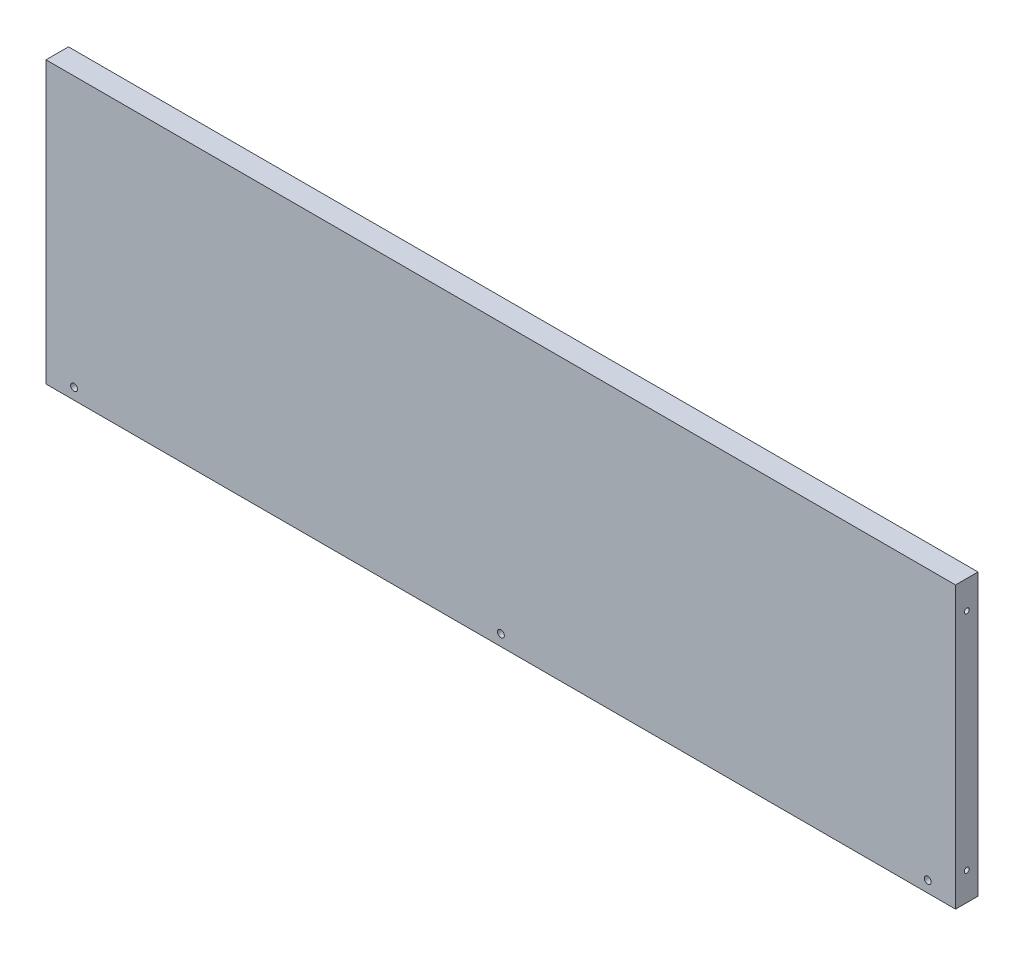
ISO-10303-21;
HEADER;
FILE_DESCRIPTION(('STEP AP214'),'2;1');
FILE_NAME('part.step','',(''),(''),'','','');
FILE_SCHEMA(('AUTOMOTIVE_DESIGN { 1 0 10303 214 1 1 1 1 }'));
ENDSEC;
DATA;
#1=APPLICATION_CONTEXT('core data for automotive mechanical design processes');
#2=APPLICATION_PROTOCOL_DEFINITION('international standard','automotive_design',2000,#1);
#3=PRODUCT_CONTEXT('',#1,'mechanical');
#4=PRODUCT('Part','Part','',(#3));
#5=PRODUCT_RELATED_PRODUCT_CATEGORY('part','',(#4));
#6=PRODUCT_DEFINITION_FORMATION('','',#4);
#7=PRODUCT_DEFINITION_CONTEXT('part definition',#1,'design');
#8=PRODUCT_DEFINITION('design','',#6,#7);
#9=PRODUCT_DEFINITION_SHAPE('','',#8);
#10=(LENGTH_UNIT() NAMED_UNIT(*) SI_UNIT(.MILLI.,.METRE.));
#11=(NAMED_UNIT(*) PLANE_ANGLE_UNIT() SI_UNIT($,.RADIAN.));
#12=(NAMED_UNIT(*) SI_UNIT($,.STERADIAN.) SOLID_ANGLE_UNIT());
#13=UNCERTAINTY_MEASURE_WITH_UNIT(LENGTH_MEASURE(1.E-05),#10,'distance_accuracy_value','');
#14=(GEOMETRIC_REPRESENTATION_CONTEXT(3) GLOBAL_UNCERTAINTY_ASSIGNED_CONTEXT((#13)) GLOBAL_UNIT_ASSIGNED_CONTEXT((#10,
#11,#12)) REPRESENTATION_CONTEXT('',''));
#15=CARTESIAN_POINT('',(0.,0.,0.));
#16=DIRECTION('',(0.,0.,1.));
#17=DIRECTION('',(1.,0.,0.));
#18=AXIS2_PLACEMENT_3D('',#15,#16,#17);
#19=CARTESIAN_POINT('',(0.,0.,8.));
#20=DIRECTION('',(0.,1.,0.));
#21=DIRECTION('',(0.,0.,1.));
#22=AXIS2_PLACEMENT_3D('',#19,#20,#21);
#23=PLANE('',#22);
#24=DIRECTION('',(0.,0.,-1.));
#25=VECTOR('',#24,1.);
#26=CARTESIAN_POINT('',(323.9,0.,8.));
#27=LINE('',#26,#25);
#28=CARTESIAN_POINT('',(323.9,0.,8.));
#29=VERTEX_POINT('',#28);
#30=CARTESIAN_POINT('',(323.9,0.,0.));
#31=VERTEX_POINT('',#30);
#32=EDGE_CURVE('E53',#29,#31,#27,.T.);
#33=ORIENTED_EDGE('',*,*,#32,.F.);
#34=DIRECTION('',(1.,0.,0.));
#35=VECTOR('',#34,1.);
#36=CARTESIAN_POINT('',(0.,0.,8.));
#37=LINE('',#36,#35);
#38=CARTESIAN_POINT('',(0.,0.,8.));
#39=VERTEX_POINT('',#38);
#40=EDGE_CURVE('E103',#39,#29,#37,.T.);
#41=ORIENTED_EDGE('',*,*,#40,.F.);
#42=DIRECTION('',(0.,0.,-1.));
#43=VECTOR('',#42,1.);
#44=CARTESIAN_POINT('',(0.,0.,8.));
#45=LINE('',#44,#43);
#46=CARTESIAN_POINT('',(0.,0.,0.));
#47=VERTEX_POINT('',#46);
#48=EDGE_CURVE('E11',#39,#47,#45,.T.);
#49=ORIENTED_EDGE('',*,*,#48,.T.);
#50=DIRECTION('',(1.,0.,0.));
#51=VECTOR('',#50,1.);
#52=CARTESIAN_POINT('',(0.,0.,0.));
#53=LINE('',#52,#51);
#54=EDGE_CURVE('E86',#47,#31,#53,.T.);
#55=ORIENTED_EDGE('',*,*,#54,.T.);
#56=EDGE_LOOP('',(#33,#41,#49,#55));
#57=FACE_BOUND('',#56,.T.);
#58=ADVANCED_FACE('F37',(#57),#23,.F.);
#59=CARTESIAN_POINT('',(0.,100.,8.));
#60=DIRECTION('',(0.,-1.,0.));
#61=DIRECTION('',(0.,0.,-1.));
#62=AXIS2_PLACEMENT_3D('',#59,#60,#61);
#63=PLANE('',#62);
#64=DIRECTION('',(0.,0.,1.));
#65=VECTOR('',#64,1.);
#66=CARTESIAN_POINT('',(323.9,100.,8.));
#67=LINE('',#66,#65);
#68=CARTESIAN_POINT('',(323.9,100.,0.));
#69=VERTEX_POINT('',#68);
#70=CARTESIAN_POINT('',(323.9,100.,8.));
#71=VERTEX_POINT('',#70);
#72=EDGE_CURVE('E82',#69,#71,#67,.T.);
#73=ORIENTED_EDGE('',*,*,#72,.F.);
#74=DIRECTION('',(-1.,0.,0.));
#75=VECTOR('',#74,1.);
#76=CARTESIAN_POINT('',(0.,100.,0.));
#77=LINE('',#76,#75);
#78=CARTESIAN_POINT('',(0.,100.,0.));
#79=VERTEX_POINT('',#78);
#80=EDGE_CURVE('E76',#69,#79,#77,.T.);
#81=ORIENTED_EDGE('',*,*,#80,.T.);
#82=DIRECTION('',(0.,0.,-1.));
#83=VECTOR('',#82,1.);
#84=CARTESIAN_POINT('',(0.,100.,8.));
#85=LINE('',#84,#83);
#86=CARTESIAN_POINT('',(0.,100.,8.));
#87=VERTEX_POINT('',#86);
#88=EDGE_CURVE('E46',#87,#79,#85,.T.);
#89=ORIENTED_EDGE('',*,*,#88,.F.);
#90=DIRECTION('',(-1.,0.,0.));
#91=VECTOR('',#90,1.);
#92=CARTESIAN_POINT('',(0.,100.,8.));
#93=LINE('',#92,#91);
#94=EDGE_CURVE('E62',#71,#87,#93,.T.);
#95=ORIENTED_EDGE('',*,*,#94,.F.);
#96=EDGE_LOOP('',(#73,#81,#89,#95));
#97=FACE_BOUND('',#96,.T.);
#98=ADVANCED_FACE('F78',(#97),#63,.F.);
#99=CARTESIAN_POINT('',(0.,0.,8.));
#100=DIRECTION('',(0.,0.,-1.));
#101=DIRECTION('',(-1.,0.,0.));
#102=AXIS2_PLACEMENT_3D('',#99,#100,#101);
#103=PLANE('',#102);
#104=CARTESIAN_POINT('',(162.,3.99999999999997,8.));
#105=DIRECTION('',(0.,0.,-1.));
#106=DIRECTION('',(-1.,0.,0.));
#107=AXIS2_PLACEMENT_3D('',#104,#105,#106);
#108=CIRCLE('',#107,1.2192);
#109=CARTESIAN_POINT('',(160.7808,3.99999999999997,8.));
#110=VERTEX_POINT('',#109);
#111=EDGE_CURVE('E95',#110,#110,#108,.T.);
#112=ORIENTED_EDGE('',*,*,#111,.T.);
#113=EDGE_LOOP('',(#112));
#114=FACE_BOUND('',#113,.T.);
#115=CARTESIAN_POINT('',(10.,4.,8.));
#116=DIRECTION('',(0.,0.,-1.));
#117=DIRECTION('',(-1.,0.,0.));
#118=AXIS2_PLACEMENT_3D('',#115,#116,#117);
#119=CIRCLE('',#118,1.2192);
#120=CARTESIAN_POINT('',(8.78080000000001,4.,8.));
#121=VERTEX_POINT('',#120);
#122=EDGE_CURVE('E115',#121,#121,#119,.T.);
#123=ORIENTED_EDGE('',*,*,#122,.T.);
#124=EDGE_LOOP('',(#123));
#125=FACE_BOUND('',#124,.T.);
#126=CARTESIAN_POINT('',(314.,3.99999999999994,8.));
#127=DIRECTION('',(0.,0.,-1.));
#128=DIRECTION('',(-1.,0.,0.));
#129=AXIS2_PLACEMENT_3D('',#126,#127,#128);
#130=CIRCLE('',#129,1.21919999999998);
#131=CARTESIAN_POINT('',(312.7808,3.99999999999994,8.));
#132=VERTEX_POINT('',#131);
#133=EDGE_CURVE('E127',#132,#132,#130,.T.);
#134=ORIENTED_EDGE('',*,*,#133,.T.);
#135=EDGE_LOOP('',(#134));
#136=FACE_BOUND('',#135,.T.);
#137=DIRECTION('',(0.,-1.,0.));
#138=VECTOR('',#137,1.);
#139=CARTESIAN_POINT('',(323.9,100.,8.));
#140=LINE('',#139,#138);
#141=EDGE_CURVE('E164',#71,#29,#140,.T.);
#142=ORIENTED_EDGE('',*,*,#141,.F.);
#143=ORIENTED_EDGE('',*,*,#94,.T.);
#144=DIRECTION('',(0.,-1.,0.));
#145=VECTOR('',#144,1.);
#146=CARTESIAN_POINT('',(0.,0.,8.));
#147=LINE('',#146,#145);
#148=EDGE_CURVE('E85',#87,#39,#147,.T.);
#149=ORIENTED_EDGE('',*,*,#148,.T.);
#150=ORIENTED_EDGE('',*,*,#40,.T.);
#151=EDGE_LOOP('',(#142,#143,#149,#150));
#152=FACE_BOUND('',#151,.T.);
#153=ADVANCED_FACE('F171',(#114,#125,#136,#152),#103,.F.);
#154=CARTESIAN_POINT('',(0.,0.,0.));
#155=DIRECTION('',(0.,0.,-1.));
#156=DIRECTION('',(-1.,0.,0.));
#157=AXIS2_PLACEMENT_3D('',#154,#155,#156);
#158=PLANE('',#157);
#159=CARTESIAN_POINT('',(314.,3.99999999999994,0.));
#160=DIRECTION('',(0.,0.,-1.));
#161=DIRECTION('',(-1.,0.,0.));
#162=AXIS2_PLACEMENT_3D('',#159,#160,#161);
#163=CIRCLE('',#162,2.38125);
#164=CARTESIAN_POINT('',(311.61875,3.99999999999994,0.));
#165=VERTEX_POINT('',#164);
#166=EDGE_CURVE('E136',#165,#165,#163,.T.);
#167=ORIENTED_EDGE('',*,*,#166,.F.);
#168=EDGE_LOOP('',(#167));
#169=FACE_BOUND('',#168,.T.);
#170=CARTESIAN_POINT('',(10.,4.,0.));
#171=DIRECTION('',(0.,0.,-1.));
#172=DIRECTION('',(-1.,0.,0.));
#173=AXIS2_PLACEMENT_3D('',#170,#171,#172);
#174=CIRCLE('',#173,2.38125);
#175=CARTESIAN_POINT('',(7.61875000000001,4.,0.));
#176=VERTEX_POINT('',#175);
#177=EDGE_CURVE('E124',#176,#176,#174,.T.);
#178=ORIENTED_EDGE('',*,*,#177,.F.);
#179=EDGE_LOOP('',(#178));
#180=FACE_BOUND('',#179,.T.);
#181=CARTESIAN_POINT('',(162.,3.99999999999997,0.));
#182=DIRECTION('',(0.,0.,-1.));
#183=DIRECTION('',(-1.,0.,0.));
#184=AXIS2_PLACEMENT_3D('',#181,#182,#183);
#185=CIRCLE('',#184,2.38125);
#186=CARTESIAN_POINT('',(159.61875,3.99999999999997,0.));
#187=VERTEX_POINT('',#186);
#188=EDGE_CURVE('E112',#187,#187,#185,.T.);
#189=ORIENTED_EDGE('',*,*,#188,.F.);
#190=EDGE_LOOP('',(#189));
#191=FACE_BOUND('',#190,.T.);
#192=ORIENTED_EDGE('',*,*,#80,.F.);
#193=DIRECTION('',(0.,1.,0.));
#194=VECTOR('',#193,1.);
#195=CARTESIAN_POINT('',(323.9,100.,0.));
#196=LINE('',#195,#194);
#197=EDGE_CURVE('E161',#31,#69,#196,.T.);
#198=ORIENTED_EDGE('',*,*,#197,.F.);
#199=ORIENTED_EDGE('',*,*,#54,.F.);
#200=DIRECTION('',(0.,-1.,0.));
#201=VECTOR('',#200,1.);
#202=CARTESIAN_POINT('',(0.,0.,0.));
#203=LINE('',#202,#201);
#204=EDGE_CURVE('E91',#79,#47,#203,.T.);
#205=ORIENTED_EDGE('',*,*,#204,.F.);
#206=EDGE_LOOP('',(#192,#198,#199,#205));
#207=FACE_BOUND('',#206,.T.);
#208=ADVANCED_FACE('F93',(#169,#180,#191,#207),#158,.T.);
#209=CARTESIAN_POINT('',(0.,0.,8.));
#210=DIRECTION('',(1.,0.,0.));
#211=DIRECTION('',(0.,0.,-1.));
#212=AXIS2_PLACEMENT_3D('',#209,#210,#211);
#213=PLANE('',#212);
#214=CARTESIAN_POINT('',(0.,90.,4.));
#215=DIRECTION('',(-1.,0.,0.));
#216=DIRECTION('',(0.,0.,1.));
#217=AXIS2_PLACEMENT_3D('',#214,#215,#216);
#218=CIRCLE('',#217,0.889000000000001);
#219=CARTESIAN_POINT('',(0.,90.,4.889));
#220=VERTEX_POINT('',#219);
#221=EDGE_CURVE('E154',#220,#220,#218,.T.);
#222=ORIENTED_EDGE('',*,*,#221,.F.);
#223=EDGE_LOOP('',(#222));
#224=FACE_BOUND('',#223,.T.);
#225=CARTESIAN_POINT('',(0.,10.,4.));
#226=DIRECTION('',(-1.,0.,0.));
#227=DIRECTION('',(0.,0.,1.));
#228=AXIS2_PLACEMENT_3D('',#225,#226,#227);
#229=CIRCLE('',#228,0.888999999999997);
#230=CARTESIAN_POINT('',(0.,10.,4.889));
#231=VERTEX_POINT('',#230);
#232=EDGE_CURVE('E148',#231,#231,#229,.T.);
#233=ORIENTED_EDGE('',*,*,#232,.F.);
#234=EDGE_LOOP('',(#233));
#235=FACE_BOUND('',#234,.T.);
#236=ORIENTED_EDGE('',*,*,#204,.T.);
#237=ORIENTED_EDGE('',*,*,#48,.F.);
#238=ORIENTED_EDGE('',*,*,#148,.F.);
#239=ORIENTED_EDGE('',*,*,#88,.T.);
#240=EDGE_LOOP('',(#236,#237,#238,#239));
#241=FACE_BOUND('',#240,.T.);
#242=ADVANCED_FACE('F39',(#224,#235,#241),#213,.F.);
#243=CARTESIAN_POINT('',(162.,3.99999999999997,0.));
#244=DIRECTION('',(0.,0.,-1.));
#245=DIRECTION('',(-1.,0.,0.));
#246=AXIS2_PLACEMENT_3D('',#243,#244,#245);
#247=CYLINDRICAL_SURFACE('',#246,1.2192);
#248=ORIENTED_EDGE('',*,*,#111,.F.);
#249=EDGE_LOOP('',(#248));
#250=FACE_BOUND('',#249,.T.);
#251=CARTESIAN_POINT('',(162.,3.99999999999997,2.1844));
#252=DIRECTION('',(0.,0.,-1.));
#253=DIRECTION('',(-1.,0.,0.));
#254=AXIS2_PLACEMENT_3D('',#251,#252,#253);
#255=CIRCLE('',#254,1.2192);
#256=CARTESIAN_POINT('',(160.7808,3.99999999999997,2.1844));
#257=VERTEX_POINT('',#256);
#258=EDGE_CURVE('E99',#257,#257,#255,.T.);
#259=ORIENTED_EDGE('',*,*,#258,.T.);
#260=EDGE_LOOP('',(#259));
#261=FACE_BOUND('',#260,.T.);
#262=ADVANCED_FACE('F348',(#250,#261),#247,.F.);
#263=CARTESIAN_POINT('',(163.2192,3.99999999999997,2.1844));
#264=DIRECTION('',(0.,0.,1.));
#265=DIRECTION('',(1.,0.,0.));
#266=AXIS2_PLACEMENT_3D('',#263,#264,#265);
#267=PLANE('',#266);
#268=ORIENTED_EDGE('',*,*,#258,.F.);
#269=EDGE_LOOP('',(#268));
#270=FACE_BOUND('',#269,.T.);
#271=CARTESIAN_POINT('',(162.,3.99999999999997,2.1844));
#272=DIRECTION('',(0.,0.,-1.));
#273=DIRECTION('',(-1.,0.,0.));
#274=AXIS2_PLACEMENT_3D('',#271,#272,#273);
#275=CIRCLE('',#274,2.38125);
#276=CARTESIAN_POINT('',(159.61875,3.99999999999997,2.1844));
#277=VERTEX_POINT('',#276);
#278=EDGE_CURVE('E109',#277,#277,#275,.T.);
#279=ORIENTED_EDGE('',*,*,#278,.T.);
#280=EDGE_LOOP('',(#279));
#281=FACE_BOUND('',#280,.T.);
#282=ADVANCED_FACE('F340',(#270,#281),#267,.F.);
#283=CARTESIAN_POINT('',(162.,3.99999999999997,0.));
#284=DIRECTION('',(0.,0.,-1.));
#285=DIRECTION('',(-1.,0.,0.));
#286=AXIS2_PLACEMENT_3D('',#283,#284,#285);
#287=CYLINDRICAL_SURFACE('',#286,2.38125);
#288=ORIENTED_EDGE('',*,*,#278,.F.);
#289=EDGE_LOOP('',(#288));
#290=FACE_BOUND('',#289,.T.);
#291=ORIENTED_EDGE('',*,*,#188,.T.);
#292=EDGE_LOOP('',(#291));
#293=FACE_BOUND('',#292,.T.);
#294=ADVANCED_FACE('F332',(#290,#293),#287,.F.);
#295=CARTESIAN_POINT('',(10.,4.,0.));
#296=DIRECTION('',(0.,0.,-1.));
#297=DIRECTION('',(-1.,0.,0.));
#298=AXIS2_PLACEMENT_3D('',#295,#296,#297);
#299=CYLINDRICAL_SURFACE('',#298,1.2192);
#300=ORIENTED_EDGE('',*,*,#122,.F.);
#301=EDGE_LOOP('',(#300));
#302=FACE_BOUND('',#301,.T.);
#303=CARTESIAN_POINT('',(10.,4.,2.1844));
#304=DIRECTION('',(0.,0.,-1.));
#305=DIRECTION('',(-1.,0.,0.));
#306=AXIS2_PLACEMENT_3D('',#303,#304,#305);
#307=CIRCLE('',#306,1.2192);
#308=CARTESIAN_POINT('',(8.78080000000001,4.,2.1844));
#309=VERTEX_POINT('',#308);
#310=EDGE_CURVE('E118',#309,#309,#307,.T.);
#311=ORIENTED_EDGE('',*,*,#310,.T.);
#312=EDGE_LOOP('',(#311));
#313=FACE_BOUND('',#312,.T.);
#314=ADVANCED_FACE('F324',(#302,#313),#299,.F.);
#315=CARTESIAN_POINT('',(11.2192,4.,2.1844));
#316=DIRECTION('',(0.,0.,1.));
#317=DIRECTION('',(1.,0.,0.));
#318=AXIS2_PLACEMENT_3D('',#315,#316,#317);
#319=PLANE('',#318);
#320=ORIENTED_EDGE('',*,*,#310,.F.);
#321=EDGE_LOOP('',(#320));
#322=FACE_BOUND('',#321,.T.);
#323=CARTESIAN_POINT('',(10.,4.,2.1844));
#324=DIRECTION('',(0.,0.,-1.));
#325=DIRECTION('',(-1.,0.,0.));
#326=AXIS2_PLACEMENT_3D('',#323,#324,#325);
#327=CIRCLE('',#326,2.38125);
#328=CARTESIAN_POINT('',(7.61875000000001,4.,2.1844));
#329=VERTEX_POINT('',#328);
#330=EDGE_CURVE('E121',#329,#329,#327,.T.);
#331=ORIENTED_EDGE('',*,*,#330,.T.);
#332=EDGE_LOOP('',(#331));
#333=FACE_BOUND('',#332,.T.);
#334=ADVANCED_FACE('F316',(#322,#333),#319,.F.);
#335=CARTESIAN_POINT('',(10.,4.,0.));
#336=DIRECTION('',(0.,0.,-1.));
#337=DIRECTION('',(-1.,0.,0.));
#338=AXIS2_PLACEMENT_3D('',#335,#336,#337);
#339=CYLINDRICAL_SURFACE('',#338,2.38125);
#340=ORIENTED_EDGE('',*,*,#330,.F.);
#341=EDGE_LOOP('',(#340));
#342=FACE_BOUND('',#341,.T.);
#343=ORIENTED_EDGE('',*,*,#177,.T.);
#344=EDGE_LOOP('',(#343));
#345=FACE_BOUND('',#344,.T.);
#346=ADVANCED_FACE('F308',(#342,#345),#339,.F.);
#347=CARTESIAN_POINT('',(314.,3.99999999999994,0.));
#348=DIRECTION('',(0.,0.,-1.));
#349=DIRECTION('',(-1.,0.,0.));
#350=AXIS2_PLACEMENT_3D('',#347,#348,#349);
#351=CYLINDRICAL_SURFACE('',#350,1.21919999999998);
#352=ORIENTED_EDGE('',*,*,#133,.F.);
#353=EDGE_LOOP('',(#352));
#354=FACE_BOUND('',#353,.T.);
#355=CARTESIAN_POINT('',(314.,3.99999999999994,2.1844));
#356=DIRECTION('',(0.,0.,-1.));
#357=DIRECTION('',(-1.,0.,0.));
#358=AXIS2_PLACEMENT_3D('',#355,#356,#357);
#359=CIRCLE('',#358,1.21919999999998);
#360=CARTESIAN_POINT('',(312.7808,3.99999999999994,2.1844));
#361=VERTEX_POINT('',#360);
#362=EDGE_CURVE('E130',#361,#361,#359,.T.);
#363=ORIENTED_EDGE('',*,*,#362,.T.);
#364=EDGE_LOOP('',(#363));
#365=FACE_BOUND('',#364,.T.);
#366=ADVANCED_FACE('F300',(#354,#365),#351,.F.);
#367=CARTESIAN_POINT('',(315.2192,3.99999999999994,2.1844));
#368=DIRECTION('',(0.,0.,1.));
#369=DIRECTION('',(1.,0.,0.));
#370=AXIS2_PLACEMENT_3D('',#367,#368,#369);
#371=PLANE('',#370);
#372=ORIENTED_EDGE('',*,*,#362,.F.);
#373=EDGE_LOOP('',(#372));
#374=FACE_BOUND('',#373,.T.);
#375=CARTESIAN_POINT('',(314.,3.99999999999994,2.1844));
#376=DIRECTION('',(0.,0.,-1.));
#377=DIRECTION('',(-1.,0.,0.));
#378=AXIS2_PLACEMENT_3D('',#375,#376,#377);
#379=CIRCLE('',#378,2.38125);
#380=CARTESIAN_POINT('',(311.61875,3.99999999999994,2.1844));
#381=VERTEX_POINT('',#380);
#382=EDGE_CURVE('E133',#381,#381,#379,.T.);
#383=ORIENTED_EDGE('',*,*,#382,.T.);
#384=EDGE_LOOP('',(#383));
#385=FACE_BOUND('',#384,.T.);
#386=ADVANCED_FACE('F291',(#374,#385),#371,.F.);
#387=CARTESIAN_POINT('',(314.,3.99999999999994,0.));
#388=DIRECTION('',(0.,0.,-1.));
#389=DIRECTION('',(-1.,0.,0.));
#390=AXIS2_PLACEMENT_3D('',#387,#388,#389);
#391=CYLINDRICAL_SURFACE('',#390,2.38125);
#392=ORIENTED_EDGE('',*,*,#382,.F.);
#393=EDGE_LOOP('',(#392));
#394=FACE_BOUND('',#393,.T.);
#395=ORIENTED_EDGE('',*,*,#166,.T.);
#396=EDGE_LOOP('',(#395));
#397=FACE_BOUND('',#396,.T.);
#398=ADVANCED_FACE('F282',(#394,#397),#391,.F.);
#399=CARTESIAN_POINT('',(15.,10.,4.));
#400=DIRECTION('',(-1.,0.,0.));
#401=DIRECTION('',(0.,0.,1.));
#402=AXIS2_PLACEMENT_3D('',#399,#400,#401);
#403=CONICAL_SURFACE('',#402,0.888999999999996,1.02974425867665);
#404=CARTESIAN_POINT('',(15.5341650903155,10.,4.));
#405=VERTEX_POINT('',#404);
#406=VERTEX_LOOP('',#405);
#407=FACE_BOUND('',#406,.T.);
#408=CARTESIAN_POINT('',(15.,10.,4.));
#409=DIRECTION('',(-1.,0.,0.));
#410=DIRECTION('',(0.,0.,1.));
#411=AXIS2_PLACEMENT_3D('',#408,#409,#410);
#412=CIRCLE('',#411,0.888999999999996);
#413=CARTESIAN_POINT('',(15.,10.,4.889));
#414=VERTEX_POINT('',#413);
#415=EDGE_CURVE('E145',#414,#414,#412,.T.);
#416=ORIENTED_EDGE('',*,*,#415,.T.);
#417=EDGE_LOOP('',(#416));
#418=FACE_BOUND('',#417,.T.);
#419=ADVANCED_FACE('F255',(#407,#418),#403,.F.);
#420=CARTESIAN_POINT('',(0.,10.,4.));
#421=DIRECTION('',(-1.,0.,0.));
#422=DIRECTION('',(0.,0.,1.));
#423=AXIS2_PLACEMENT_3D('',#420,#421,#422);
#424=CYLINDRICAL_SURFACE('',#423,0.888999999999997);
#425=ORIENTED_EDGE('',*,*,#415,.F.);
#426=EDGE_LOOP('',(#425));
#427=FACE_BOUND('',#426,.T.);
#428=ORIENTED_EDGE('',*,*,#232,.T.);
#429=EDGE_LOOP('',(#428));
#430=FACE_BOUND('',#429,.T.);
#431=ADVANCED_FACE('F248',(#427,#430),#424,.F.);
#432=CARTESIAN_POINT('',(15.,90.,4.));
#433=DIRECTION('',(-1.,0.,0.));
#434=DIRECTION('',(0.,0.,1.));
#435=AXIS2_PLACEMENT_3D('',#432,#433,#434);
#436=CONICAL_SURFACE('',#435,0.889000000000001,1.02974425867665);
#437=CARTESIAN_POINT('',(15.5341650903155,90.,4.));
#438=VERTEX_POINT('',#437);
#439=VERTEX_LOOP('',#438);
#440=FACE_BOUND('',#439,.T.);
#441=CARTESIAN_POINT('',(15.,90.,4.));
#442=DIRECTION('',(-1.,0.,0.));
#443=DIRECTION('',(0.,0.,1.));
#444=AXIS2_PLACEMENT_3D('',#441,#442,#443);
#445=CIRCLE('',#444,0.889000000000001);
#446=CARTESIAN_POINT('',(15.,90.,4.889));
#447=VERTEX_POINT('',#446);
#448=EDGE_CURVE('E151',#447,#447,#445,.T.);
#449=ORIENTED_EDGE('',*,*,#448,.T.);
#450=EDGE_LOOP('',(#449));
#451=FACE_BOUND('',#450,.T.);
#452=ADVANCED_FACE('F254',(#440,#451),#436,.F.);
#453=CARTESIAN_POINT('',(0.,90.,4.));
#454=DIRECTION('',(-1.,0.,0.));
#455=DIRECTION('',(0.,0.,1.));
#456=AXIS2_PLACEMENT_3D('',#453,#454,#455);
#457=CYLINDRICAL_SURFACE('',#456,0.889000000000001);
#458=ORIENTED_EDGE('',*,*,#448,.F.);
#459=EDGE_LOOP('',(#458));
#460=FACE_BOUND('',#459,.T.);
#461=ORIENTED_EDGE('',*,*,#221,.T.);
#462=EDGE_LOOP('',(#461));
#463=FACE_BOUND('',#462,.T.);
#464=ADVANCED_FACE('F214',(#460,#463),#457,.F.);
#465=CARTESIAN_POINT('',(323.9,0.,0.));
#466=DIRECTION('',(1.,0.,0.));
#467=DIRECTION('',(0.,0.,-1.));
#468=AXIS2_PLACEMENT_3D('',#465,#466,#467);
#469=PLANE('',#468);
#470=ORIENTED_EDGE('',*,*,#141,.T.);
#471=ORIENTED_EDGE('',*,*,#32,.T.);
#472=ORIENTED_EDGE('',*,*,#197,.T.);
#473=ORIENTED_EDGE('',*,*,#72,.T.);
#474=EDGE_LOOP('',(#470,#471,#472,#473));
#475=FACE_BOUND('',#474,.T.);
#476=CARTESIAN_POINT('',(323.9,90.,4.));
#477=DIRECTION('',(1.,0.,0.));
#478=DIRECTION('',(0.,0.,-1.));
#479=AXIS2_PLACEMENT_3D('',#476,#477,#478);
#480=CIRCLE('',#479,0.889000000000001);
#481=CARTESIAN_POINT('',(323.9,90.,3.111));
#482=VERTEX_POINT('',#481);
#483=EDGE_CURVE('E41',#482,#482,#480,.F.);
#484=ORIENTED_EDGE('',*,*,#483,.T.);
#485=EDGE_LOOP('',(#484));
#486=FACE_BOUND('',#485,.T.);
#487=CARTESIAN_POINT('',(323.9,10.,4.));
#488=DIRECTION('',(1.,0.,0.));
#489=DIRECTION('',(0.,0.,-1.));
#490=AXIS2_PLACEMENT_3D('',#487,#488,#489);
#491=CIRCLE('',#490,0.888999999999997);
#492=CARTESIAN_POINT('',(323.9,10.,3.111));
#493=VERTEX_POINT('',#492);
#494=EDGE_CURVE('E157',#493,#493,#491,.F.);
#495=ORIENTED_EDGE('',*,*,#494,.T.);
#496=EDGE_LOOP('',(#495));
#497=FACE_BOUND('',#496,.T.);
#498=ADVANCED_FACE('F166',(#475,#486,#497),#469,.T.);
#499=CARTESIAN_POINT('',(309.,10.,4.));
#500=DIRECTION('',(1.,0.,0.));
#501=DIRECTION('',(0.,0.,-1.));
#502=AXIS2_PLACEMENT_3D('',#499,#500,#501);
#503=CONICAL_SURFACE('',#502,0.888999999999996,1.02974425867664);
#504=CARTESIAN_POINT('',(308.465834909684,10.,4.));
#505=VERTEX_POINT('',#504);
#506=VERTEX_LOOP('',#505);
#507=FACE_BOUND('',#506,.T.);
#508=CARTESIAN_POINT('',(309.,10.,4.));
#509=DIRECTION('',(1.,0.,0.));
#510=DIRECTION('',(0.,0.,-1.));
#511=AXIS2_PLACEMENT_3D('',#508,#509,#510);
#512=CIRCLE('',#511,0.888999999999996);
#513=CARTESIAN_POINT('',(309.,10.,3.111));
#514=VERTEX_POINT('',#513);
#515=EDGE_CURVE('E139',#514,#514,#512,.T.);
#516=ORIENTED_EDGE('',*,*,#515,.T.);
#517=EDGE_LOOP('',(#516));
#518=FACE_BOUND('',#517,.T.);
#519=ADVANCED_FACE('F213',(#507,#518),#503,.F.);
#520=CARTESIAN_POINT('',(324.,10.,4.));
#521=DIRECTION('',(1.,0.,0.));
#522=DIRECTION('',(0.,0.,-1.));
#523=AXIS2_PLACEMENT_3D('',#520,#521,#522);
#524=CYLINDRICAL_SURFACE('',#523,0.888999999999997);
#525=ORIENTED_EDGE('',*,*,#515,.F.);
#526=EDGE_LOOP('',(#525));
#527=FACE_BOUND('',#526,.T.);
#528=ORIENTED_EDGE('',*,*,#494,.F.);
#529=EDGE_LOOP('',(#528));
#530=FACE_BOUND('',#529,.T.);
#531=ADVANCED_FACE('F221',(#527,#530),#524,.F.);
#532=CARTESIAN_POINT('',(309.,90.,4.));
#533=DIRECTION('',(1.,0.,0.));
#534=DIRECTION('',(0.,0.,-1.));
#535=AXIS2_PLACEMENT_3D('',#532,#533,#534);
#536=CONICAL_SURFACE('',#535,0.889000000000001,1.02974425867665);
#537=CARTESIAN_POINT('',(308.465834909684,90.,4.));
#538=VERTEX_POINT('',#537);
#539=VERTEX_LOOP('',#538);
#540=FACE_BOUND('',#539,.T.);
#541=CARTESIAN_POINT('',(309.,90.,4.));
#542=DIRECTION('',(1.,0.,0.));
#543=DIRECTION('',(0.,0.,-1.));
#544=AXIS2_PLACEMENT_3D('',#541,#542,#543);
#545=CIRCLE('',#544,0.889000000000001);
#546=CARTESIAN_POINT('',(309.,90.,3.111));
#547=VERTEX_POINT('',#546);
#548=EDGE_CURVE('E142',#547,#547,#545,.T.);
#549=ORIENTED_EDGE('',*,*,#548,.T.);
#550=EDGE_LOOP('',(#549));
#551=FACE_BOUND('',#550,.T.);
#552=ADVANCED_FACE('F226',(#540,#551),#536,.F.);
#553=CARTESIAN_POINT('',(324.,90.,4.));
#554=DIRECTION('',(1.,0.,0.));
#555=DIRECTION('',(0.,0.,-1.));
#556=AXIS2_PLACEMENT_3D('',#553,#554,#555);
#557=CYLINDRICAL_SURFACE('',#556,0.889000000000001);
#558=ORIENTED_EDGE('',*,*,#548,.F.);
#559=EDGE_LOOP('',(#558));
#560=FACE_BOUND('',#559,.T.);
#561=ORIENTED_EDGE('',*,*,#483,.F.);
#562=EDGE_LOOP('',(#561));
#563=FACE_BOUND('',#562,.T.);
#564=ADVANCED_FACE('F235',(#560,#563),#557,.F.);
#565=CLOSED_SHELL('',(#58,#98,#153,#208,#242,#262,#282,#294,#314,#334,#346,#366,#386,#398,#419,
#431,#452,#464,#498,#519,#531,#552,#564));
#566=MANIFOLD_SOLID_BREP('B2',#565);
#567=ADVANCED_BREP_SHAPE_REPRESENTATION('',(#18,#566),#14);
#568=SHAPE_DEFINITION_REPRESENTATION(#9,#567);
ENDSEC;
END-ISO-10303-21;
